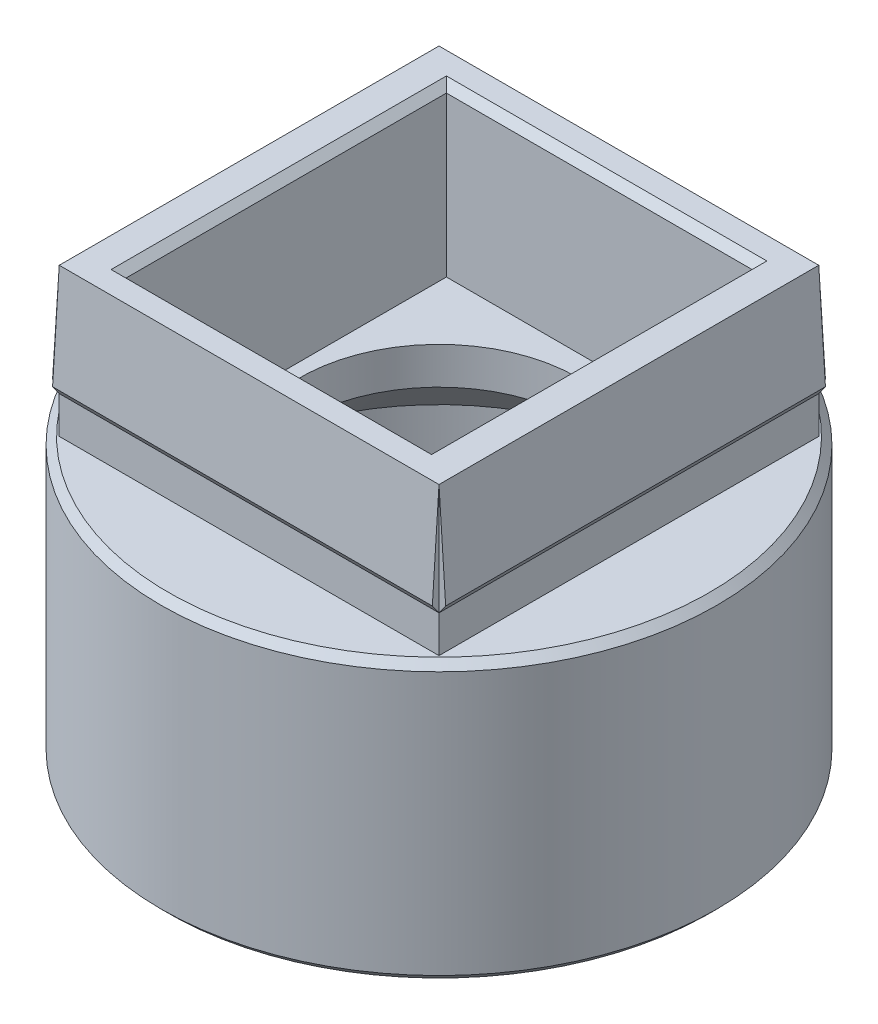
ISO-10303-21;
HEADER;
FILE_DESCRIPTION(('STEP AP214'),'2;1');
FILE_NAME('part.step','',(''),(''),'','','');
FILE_SCHEMA(('AUTOMOTIVE_DESIGN { 1 0 10303 214 1 1 1 1 }'));
ENDSEC;
DATA;
#1=APPLICATION_CONTEXT('core data for automotive mechanical design processes');
#2=APPLICATION_PROTOCOL_DEFINITION('international standard','automotive_design',2000,#1);
#3=PRODUCT_CONTEXT('',#1,'mechanical');
#4=PRODUCT('Part','Part','',(#3));
#5=PRODUCT_RELATED_PRODUCT_CATEGORY('part','',(#4));
#6=PRODUCT_DEFINITION_FORMATION('','',#4);
#7=PRODUCT_DEFINITION_CONTEXT('part definition',#1,'design');
#8=PRODUCT_DEFINITION('design','',#6,#7);
#9=PRODUCT_DEFINITION_SHAPE('','',#8);
#10=(LENGTH_UNIT() NAMED_UNIT(*) SI_UNIT(.MILLI.,.METRE.));
#11=(NAMED_UNIT(*) PLANE_ANGLE_UNIT() SI_UNIT($,.RADIAN.));
#12=(NAMED_UNIT(*) SI_UNIT($,.STERADIAN.) SOLID_ANGLE_UNIT());
#13=UNCERTAINTY_MEASURE_WITH_UNIT(LENGTH_MEASURE(1.E-05),#10,'distance_accuracy_value','');
#14=(GEOMETRIC_REPRESENTATION_CONTEXT(3) GLOBAL_UNCERTAINTY_ASSIGNED_CONTEXT((#13)) GLOBAL_UNIT_ASSIGNED_CONTEXT((#10,
#11,#12)) REPRESENTATION_CONTEXT('',''));
#15=CARTESIAN_POINT('',(0.,0.,0.));
#16=DIRECTION('',(0.,0.,1.));
#17=DIRECTION('',(1.,0.,0.));
#18=AXIS2_PLACEMENT_3D('',#15,#16,#17);
#19=CARTESIAN_POINT('',(0.,-7.5,0.));
#20=DIRECTION('',(0.,1.,0.));
#21=DIRECTION('',(0.,0.,1.));
#22=AXIS2_PLACEMENT_3D('',#19,#20,#21);
#23=CYLINDRICAL_SURFACE('',#22,6.);
#24=CARTESIAN_POINT('',(0.,-3.50000000000003,0.));
#25=DIRECTION('',(0.,1.,0.));
#26=DIRECTION('',(0.,0.,1.));
#27=AXIS2_PLACEMENT_3D('',#24,#25,#26);
#28=CIRCLE('',#27,6.);
#29=CARTESIAN_POINT('',(0.,-3.50000000000003,6.));
#30=VERTEX_POINT('',#29);
#31=EDGE_CURVE('E51',#30,#30,#28,.T.);
#32=ORIENTED_EDGE('',*,*,#31,.T.);
#33=EDGE_LOOP('',(#32));
#34=FACE_BOUND('',#33,.T.);
#35=CARTESIAN_POINT('',(0.,-6.49999999999998,0.));
#36=DIRECTION('',(0.,-1.,0.));
#37=DIRECTION('',(0.,0.,-1.));
#38=AXIS2_PLACEMENT_3D('',#35,#36,#37);
#39=CIRCLE('',#38,6.);
#40=CARTESIAN_POINT('',(0.,-6.49999999999998,-6.));
#41=VERTEX_POINT('',#40);
#42=EDGE_CURVE('E189',#41,#41,#39,.T.);
#43=ORIENTED_EDGE('',*,*,#42,.T.);
#44=EDGE_LOOP('',(#43));
#45=FACE_BOUND('',#44,.T.);
#46=ADVANCED_FACE('F41',(#34,#45),#23,.F.);
#47=CARTESIAN_POINT('',(5.125,4.,5.125));
#48=DIRECTION('',(-1.,0.,0.));
#49=DIRECTION('',(0.,0.,1.));
#50=AXIS2_PLACEMENT_3D('',#47,#48,#49);
#51=PLANE('',#50);
#52=DIRECTION('',(0.,1.,0.));
#53=VECTOR('',#52,1.);
#54=CARTESIAN_POINT('',(5.12500000000005,1.,-5.12499999999995));
#55=LINE('',#54,#53);
#56=CARTESIAN_POINT('',(5.12500000000005,1.,-5.12499999999995));
#57=VERTEX_POINT('',#56);
#58=CARTESIAN_POINT('',(5.12500000000005,4.,-5.12499999999995));
#59=VERTEX_POINT('',#58);
#60=EDGE_CURVE('E391',#57,#59,#55,.T.);
#61=ORIENTED_EDGE('',*,*,#60,.F.);
#62=DIRECTION('',(0.,-0.811534341451495,0.584304725845075));
#63=VECTOR('',#62,1.);
#64=CARTESIAN_POINT('',(5.125,1.25,-5.305));
#65=LINE('',#64,#63);
#66=CARTESIAN_POINT('',(5.125,1.25,-5.305));
#67=VERTEX_POINT('',#66);
#68=EDGE_CURVE('E357',#67,#57,#65,.T.);
#69=ORIENTED_EDGE('',*,*,#68,.F.);
#70=DIRECTION('',(0.,-0.99786470995867,-0.0653147810154764));
#71=VECTOR('',#70,1.);
#72=CARTESIAN_POINT('',(5.125,4.,-5.125));
#73=LINE('',#72,#71);
#74=EDGE_CURVE('E351',#59,#67,#73,.T.);
#75=ORIENTED_EDGE('',*,*,#74,.F.);
#76=EDGE_LOOP('',(#61,#69,#75));
#77=FACE_BOUND('',#76,.T.);
#78=ADVANCED_FACE('F436',(#77),#51,.F.);
#79=DIRECTION('',(0.,0.,-1.));
#80=VECTOR('',#79,1.);
#81=CARTESIAN_POINT('',(5.12499999999995,1.,5.12500000000006));
#82=LINE('',#81,#80);
#83=CARTESIAN_POINT('',(5.12499999999995,1.,5.12500000000006));
#84=VERTEX_POINT('',#83);
#85=EDGE_CURVE('E387',#84,#57,#82,.T.);
#86=ORIENTED_EDGE('',*,*,#85,.F.);
#87=DIRECTION('',(0.,-1.,0.));
#88=VECTOR('',#87,1.);
#89=CARTESIAN_POINT('',(5.125,4.,5.125));
#90=LINE('',#89,#88);
#91=CARTESIAN_POINT('',(5.125,0.,5.125));
#92=VERTEX_POINT('',#91);
#93=EDGE_CURVE('E262',#84,#92,#90,.T.);
#94=ORIENTED_EDGE('',*,*,#93,.T.);
#95=DIRECTION('',(0.,0.,-1.));
#96=VECTOR('',#95,1.);
#97=CARTESIAN_POINT('',(5.125,0.,5.125));
#98=LINE('',#97,#96);
#99=CARTESIAN_POINT('',(5.125,0.,-5.125));
#100=VERTEX_POINT('',#99);
#101=EDGE_CURVE('E280',#92,#100,#98,.T.);
#102=ORIENTED_EDGE('',*,*,#101,.T.);
#103=DIRECTION('',(0.,-1.,0.));
#104=VECTOR('',#103,1.);
#105=CARTESIAN_POINT('',(5.125,4.,-5.125));
#106=LINE('',#105,#104);
#107=EDGE_CURVE('E250',#57,#100,#106,.T.);
#108=ORIENTED_EDGE('',*,*,#107,.F.);
#109=EDGE_LOOP('',(#86,#94,#102,#108));
#110=FACE_BOUND('',#109,.T.);
#111=ADVANCED_FACE('F441',(#110),#51,.F.);
#112=CARTESIAN_POINT('',(-5.125,4.,-5.125));
#113=DIRECTION('',(0.,0.,1.));
#114=DIRECTION('',(1.,0.,0.));
#115=AXIS2_PLACEMENT_3D('',#112,#113,#114);
#116=PLANE('',#115);
#117=DIRECTION('',(0.,1.,0.));
#118=VECTOR('',#117,1.);
#119=CARTESIAN_POINT('',(-5.125,1.,-5.125));
#120=LINE('',#119,#118);
#121=CARTESIAN_POINT('',(-5.125,1.,-5.125));
#122=VERTEX_POINT('',#121);
#123=CARTESIAN_POINT('',(-5.125,4.,-5.125));
#124=VERTEX_POINT('',#123);
#125=EDGE_CURVE('E362',#122,#124,#120,.T.);
#126=ORIENTED_EDGE('',*,*,#125,.F.);
#127=DIRECTION('',(0.584304725845075,-0.811534341451495,0.));
#128=VECTOR('',#127,1.);
#129=CARTESIAN_POINT('',(-5.30499999999998,1.25,-5.12500000000002));
#130=LINE('',#129,#128);
#131=CARTESIAN_POINT('',(-5.30499999999998,1.25,-5.12500000000002));
#132=VERTEX_POINT('',#131);
#133=EDGE_CURVE('E328',#132,#122,#130,.T.);
#134=ORIENTED_EDGE('',*,*,#133,.F.);
#135=DIRECTION('',(-0.0653147810154764,-0.99786470995867,0.));
#136=VECTOR('',#135,1.);
#137=CARTESIAN_POINT('',(-5.12499999999998,4.,-5.12500000000002));
#138=LINE('',#137,#136);
#139=EDGE_CURVE('E336',#124,#132,#138,.T.);
#140=ORIENTED_EDGE('',*,*,#139,.F.);
#141=EDGE_LOOP('',(#126,#134,#140));
#142=FACE_BOUND('',#141,.T.);
#143=ADVANCED_FACE('F532',(#142),#116,.F.);
#144=DIRECTION('',(-1.,0.,0.));
#145=VECTOR('',#144,1.);
#146=CARTESIAN_POINT('',(5.125,1.,-5.125));
#147=LINE('',#146,#145);
#148=EDGE_CURVE('E356',#57,#122,#147,.T.);
#149=ORIENTED_EDGE('',*,*,#148,.F.);
#150=ORIENTED_EDGE('',*,*,#107,.T.);
#151=DIRECTION('',(-1.,0.,0.));
#152=VECTOR('',#151,1.);
#153=CARTESIAN_POINT('',(-5.125,0.,-5.125));
#154=LINE('',#153,#152);
#155=CARTESIAN_POINT('',(-5.125,0.,-5.125));
#156=VERTEX_POINT('',#155);
#157=EDGE_CURVE('E276',#100,#156,#154,.T.);
#158=ORIENTED_EDGE('',*,*,#157,.T.);
#159=DIRECTION('',(0.,-1.,0.));
#160=VECTOR('',#159,1.);
#161=CARTESIAN_POINT('',(-5.125,4.,-5.125));
#162=LINE('',#161,#160);
#163=EDGE_CURVE('E254',#122,#156,#162,.T.);
#164=ORIENTED_EDGE('',*,*,#163,.F.);
#165=EDGE_LOOP('',(#149,#150,#158,#164));
#166=FACE_BOUND('',#165,.T.);
#167=ADVANCED_FACE('F530',(#166),#116,.F.);
#168=CARTESIAN_POINT('',(-5.125,4.,5.125));
#169=DIRECTION('',(1.,0.,0.));
#170=DIRECTION('',(0.,0.,-1.));
#171=AXIS2_PLACEMENT_3D('',#168,#169,#170);
#172=PLANE('',#171);
#173=DIRECTION('',(0.,1.,0.));
#174=VECTOR('',#173,1.);
#175=CARTESIAN_POINT('',(-5.12500000000002,1.,5.12499999999998));
#176=LINE('',#175,#174);
#177=CARTESIAN_POINT('',(-5.12500000000002,1.,5.12499999999998));
#178=VERTEX_POINT('',#177);
#179=CARTESIAN_POINT('',(-5.125,4.,5.125));
#180=VERTEX_POINT('',#179);
#181=EDGE_CURVE('E341',#178,#180,#176,.T.);
#182=ORIENTED_EDGE('',*,*,#181,.F.);
#183=DIRECTION('',(0.,-0.811534341451495,-0.584304725845075));
#184=VECTOR('',#183,1.);
#185=CARTESIAN_POINT('',(-5.125,1.25,5.305));
#186=LINE('',#185,#184);
#187=CARTESIAN_POINT('',(-5.125,1.25,5.305));
#188=VERTEX_POINT('',#187);
#189=EDGE_CURVE('E306',#188,#178,#186,.T.);
#190=ORIENTED_EDGE('',*,*,#189,.F.);
#191=DIRECTION('',(0.,-0.99786470995867,0.0653147810154764));
#192=VECTOR('',#191,1.);
#193=CARTESIAN_POINT('',(-5.125,4.,5.125));
#194=LINE('',#193,#192);
#195=EDGE_CURVE('E314',#180,#188,#194,.T.);
#196=ORIENTED_EDGE('',*,*,#195,.F.);
#197=EDGE_LOOP('',(#182,#190,#196));
#198=FACE_BOUND('',#197,.T.);
#199=ADVANCED_FACE('F527',(#198),#172,.F.);
#200=DIRECTION('',(0.,0.,1.));
#201=VECTOR('',#200,1.);
#202=CARTESIAN_POINT('',(-5.12499999999998,1.,-5.12500000000002));
#203=LINE('',#202,#201);
#204=EDGE_CURVE('E319',#122,#178,#203,.T.);
#205=ORIENTED_EDGE('',*,*,#204,.F.);
#206=ORIENTED_EDGE('',*,*,#163,.T.);
#207=DIRECTION('',(0.,0.,1.));
#208=VECTOR('',#207,1.);
#209=CARTESIAN_POINT('',(-5.125,0.,5.125));
#210=LINE('',#209,#208);
#211=CARTESIAN_POINT('',(-5.125,0.,5.125));
#212=VERTEX_POINT('',#211);
#213=EDGE_CURVE('E272',#156,#212,#210,.T.);
#214=ORIENTED_EDGE('',*,*,#213,.T.);
#215=DIRECTION('',(0.,-1.,0.));
#216=VECTOR('',#215,1.);
#217=CARTESIAN_POINT('',(-5.125,4.,5.125));
#218=LINE('',#217,#216);
#219=EDGE_CURVE('E258',#178,#212,#218,.T.);
#220=ORIENTED_EDGE('',*,*,#219,.F.);
#221=EDGE_LOOP('',(#205,#206,#214,#220));
#222=FACE_BOUND('',#221,.T.);
#223=ADVANCED_FACE('F525',(#222),#172,.F.);
#224=CARTESIAN_POINT('',(-5.125,4.,5.125));
#225=DIRECTION('',(0.,0.,-1.));
#226=DIRECTION('',(-1.,0.,0.));
#227=AXIS2_PLACEMENT_3D('',#224,#225,#226);
#228=PLANE('',#227);
#229=DIRECTION('',(1.,0.,0.));
#230=VECTOR('',#229,1.);
#231=CARTESIAN_POINT('',(-5.125,1.,5.125));
#232=LINE('',#231,#230);
#233=EDGE_CURVE('E170',#178,#84,#232,.T.);
#234=ORIENTED_EDGE('',*,*,#233,.F.);
#235=ORIENTED_EDGE('',*,*,#219,.T.);
#236=DIRECTION('',(1.,0.,0.));
#237=VECTOR('',#236,1.);
#238=CARTESIAN_POINT('',(-5.125,0.,5.125));
#239=LINE('',#238,#237);
#240=EDGE_CURVE('E267',#212,#92,#239,.T.);
#241=ORIENTED_EDGE('',*,*,#240,.T.);
#242=ORIENTED_EDGE('',*,*,#93,.F.);
#243=EDGE_LOOP('',(#234,#235,#241,#242));
#244=FACE_BOUND('',#243,.T.);
#245=ADVANCED_FACE('F521',(#244),#228,.F.);
#246=CARTESIAN_POINT('',(0.,4.,0.));
#247=DIRECTION('',(0.,-1.,0.));
#248=DIRECTION('',(0.,0.,-1.));
#249=AXIS2_PLACEMENT_3D('',#246,#247,#248);
#250=PLANE('',#249);
#251=DIRECTION('',(-1.,0.,0.));
#252=VECTOR('',#251,1.);
#253=CARTESIAN_POINT('',(-4.125,4.,4.525));
#254=LINE('',#253,#252);
#255=CARTESIAN_POINT('',(4.325,4.,4.525));
#256=VERTEX_POINT('',#255);
#257=CARTESIAN_POINT('',(-4.325,4.,4.525));
#258=VERTEX_POINT('',#257);
#259=EDGE_CURVE('E237',#256,#258,#254,.T.);
#260=ORIENTED_EDGE('',*,*,#259,.T.);
#261=DIRECTION('',(0.,0.,-1.));
#262=VECTOR('',#261,1.);
#263=CARTESIAN_POINT('',(-4.325,4.,-4.325));
#264=LINE('',#263,#262);
#265=CARTESIAN_POINT('',(-4.325,4.,-4.525));
#266=VERTEX_POINT('',#265);
#267=EDGE_CURVE('E233',#258,#266,#264,.T.);
#268=ORIENTED_EDGE('',*,*,#267,.T.);
#269=DIRECTION('',(1.,0.,0.));
#270=VECTOR('',#269,1.);
#271=CARTESIAN_POINT('',(4.125,4.,-4.525));
#272=LINE('',#271,#270);
#273=CARTESIAN_POINT('',(4.325,4.,-4.525));
#274=VERTEX_POINT('',#273);
#275=EDGE_CURVE('E243',#266,#274,#272,.T.);
#276=ORIENTED_EDGE('',*,*,#275,.T.);
#277=DIRECTION('',(0.,0.,1.));
#278=VECTOR('',#277,1.);
#279=CARTESIAN_POINT('',(4.325,4.,4.325));
#280=LINE('',#279,#278);
#281=EDGE_CURVE('E240',#274,#256,#280,.T.);
#282=ORIENTED_EDGE('',*,*,#281,.T.);
#283=EDGE_LOOP('',(#260,#268,#276,#282));
#284=FACE_BOUND('',#283,.T.);
#285=DIRECTION('',(0.,0.,-1.));
#286=VECTOR('',#285,1.);
#287=CARTESIAN_POINT('',(5.125,4.,5.125));
#288=LINE('',#287,#286);
#289=CARTESIAN_POINT('',(5.125,4.,5.125));
#290=VERTEX_POINT('',#289);
#291=EDGE_CURVE('E271',#290,#59,#288,.T.);
#292=ORIENTED_EDGE('',*,*,#291,.T.);
#293=DIRECTION('',(-1.,0.,0.));
#294=VECTOR('',#293,1.);
#295=CARTESIAN_POINT('',(-5.125,4.,-5.125));
#296=LINE('',#295,#294);
#297=EDGE_CURVE('E290',#59,#124,#296,.T.);
#298=ORIENTED_EDGE('',*,*,#297,.T.);
#299=DIRECTION('',(0.,0.,1.));
#300=VECTOR('',#299,1.);
#301=CARTESIAN_POINT('',(-5.125,4.,5.125));
#302=LINE('',#301,#300);
#303=EDGE_CURVE('E287',#124,#180,#302,.T.);
#304=ORIENTED_EDGE('',*,*,#303,.T.);
#305=DIRECTION('',(1.,0.,0.));
#306=VECTOR('',#305,1.);
#307=CARTESIAN_POINT('',(-5.125,4.,5.125));
#308=LINE('',#307,#306);
#309=EDGE_CURVE('E266',#180,#290,#308,.T.);
#310=ORIENTED_EDGE('',*,*,#309,.T.);
#311=EDGE_LOOP('',(#292,#298,#304,#310));
#312=FACE_BOUND('',#311,.T.);
#313=ADVANCED_FACE('F518',(#284,#312),#250,.F.);
#314=DIRECTION('',(0.,-0.811534341451495,-0.584304725845075));
#315=VECTOR('',#314,1.);
#316=CARTESIAN_POINT('',(5.125,1.25,5.305));
#317=LINE('',#316,#315);
#318=CARTESIAN_POINT('',(5.125,1.25,5.305));
#319=VERTEX_POINT('',#318);
#320=EDGE_CURVE('E310',#319,#84,#317,.T.);
#321=ORIENTED_EDGE('',*,*,#320,.T.);
#322=DIRECTION('',(0.,1.,0.));
#323=VECTOR('',#322,1.);
#324=CARTESIAN_POINT('',(5.12499999999995,1.,5.12500000000006));
#325=LINE('',#324,#323);
#326=EDGE_CURVE('E200',#84,#290,#325,.T.);
#327=ORIENTED_EDGE('',*,*,#326,.T.);
#328=DIRECTION('',(0.,-0.99786470995867,0.0653147810154764));
#329=VECTOR('',#328,1.);
#330=CARTESIAN_POINT('',(5.125,4.,5.125));
#331=LINE('',#330,#329);
#332=EDGE_CURVE('E315',#290,#319,#331,.T.);
#333=ORIENTED_EDGE('',*,*,#332,.T.);
#334=EDGE_LOOP('',(#321,#327,#333));
#335=FACE_BOUND('',#334,.T.);
#336=ADVANCED_FACE('F444',(#335),#51,.F.);
#337=CARTESIAN_POINT('',(4.125,4.,4.325));
#338=DIRECTION('',(-1.,0.,0.));
#339=DIRECTION('',(0.,0.,1.));
#340=AXIS2_PLACEMENT_3D('',#337,#338,#339);
#341=PLANE('',#340);
#342=DIRECTION('',(0.,0.,-1.));
#343=VECTOR('',#342,1.);
#344=CARTESIAN_POINT('',(4.125,-0.5,4.325));
#345=LINE('',#344,#343);
#346=CARTESIAN_POINT('',(4.125,-0.5,4.325));
#347=VERTEX_POINT('',#346);
#348=CARTESIAN_POINT('',(4.125,-0.5,-4.325));
#349=VERTEX_POINT('',#348);
#350=EDGE_CURVE('E173',#347,#349,#345,.T.);
#351=ORIENTED_EDGE('',*,*,#350,.F.);
#352=DIRECTION('',(0.,-1.,0.));
#353=VECTOR('',#352,1.);
#354=CARTESIAN_POINT('',(4.125,4.,4.325));
#355=LINE('',#354,#353);
#356=CARTESIAN_POINT('',(4.125,3.8,4.325));
#357=VERTEX_POINT('',#356);
#358=EDGE_CURVE('E158',#357,#347,#355,.T.);
#359=ORIENTED_EDGE('',*,*,#358,.F.);
#360=DIRECTION('',(0.,0.,-1.));
#361=VECTOR('',#360,1.);
#362=CARTESIAN_POINT('',(4.125,3.8,-4.325));
#363=LINE('',#362,#361);
#364=CARTESIAN_POINT('',(4.125,3.8,-4.325));
#365=VERTEX_POINT('',#364);
#366=EDGE_CURVE('E228',#357,#365,#363,.T.);
#367=ORIENTED_EDGE('',*,*,#366,.T.);
#368=DIRECTION('',(0.,-1.,0.));
#369=VECTOR('',#368,1.);
#370=CARTESIAN_POINT('',(4.125,4.,-4.325));
#371=LINE('',#370,#369);
#372=EDGE_CURVE('E175',#365,#349,#371,.T.);
#373=ORIENTED_EDGE('',*,*,#372,.T.);
#374=EDGE_LOOP('',(#351,#359,#367,#373));
#375=FACE_BOUND('',#374,.T.);
#376=ADVANCED_FACE('F174',(#375),#341,.T.);
#377=CARTESIAN_POINT('',(-4.125,4.,-4.325));
#378=DIRECTION('',(0.,0.,1.));
#379=DIRECTION('',(1.,0.,0.));
#380=AXIS2_PLACEMENT_3D('',#377,#378,#379);
#381=PLANE('',#380);
#382=DIRECTION('',(-1.,0.,0.));
#383=VECTOR('',#382,1.);
#384=CARTESIAN_POINT('',(-4.125,-0.5,-4.325));
#385=LINE('',#384,#383);
#386=CARTESIAN_POINT('',(-4.125,-0.5,-4.325));
#387=VERTEX_POINT('',#386);
#388=EDGE_CURVE('E58',#349,#387,#385,.T.);
#389=ORIENTED_EDGE('',*,*,#388,.F.);
#390=ORIENTED_EDGE('',*,*,#372,.F.);
#391=DIRECTION('',(-1.,0.,0.));
#392=VECTOR('',#391,1.);
#393=CARTESIAN_POINT('',(-4.125,3.8,-4.325));
#394=LINE('',#393,#392);
#395=CARTESIAN_POINT('',(-4.125,3.8,-4.325));
#396=VERTEX_POINT('',#395);
#397=EDGE_CURVE('E225',#365,#396,#394,.T.);
#398=ORIENTED_EDGE('',*,*,#397,.T.);
#399=DIRECTION('',(0.,-1.,0.));
#400=VECTOR('',#399,1.);
#401=CARTESIAN_POINT('',(-4.125,4.,-4.325));
#402=LINE('',#401,#400);
#403=EDGE_CURVE('E298',#396,#387,#402,.T.);
#404=ORIENTED_EDGE('',*,*,#403,.T.);
#405=EDGE_LOOP('',(#389,#390,#398,#404));
#406=FACE_BOUND('',#405,.T.);
#407=ADVANCED_FACE('F513',(#406),#381,.T.);
#408=CARTESIAN_POINT('',(-4.125,4.,4.325));
#409=DIRECTION('',(1.,0.,0.));
#410=DIRECTION('',(0.,0.,-1.));
#411=AXIS2_PLACEMENT_3D('',#408,#409,#410);
#412=PLANE('',#411);
#413=DIRECTION('',(0.,0.,1.));
#414=VECTOR('',#413,1.);
#415=CARTESIAN_POINT('',(-4.125,-0.5,4.325));
#416=LINE('',#415,#414);
#417=CARTESIAN_POINT('',(-4.125,-0.5,4.325));
#418=VERTEX_POINT('',#417);
#419=EDGE_CURVE('E66',#387,#418,#416,.T.);
#420=ORIENTED_EDGE('',*,*,#419,.F.);
#421=ORIENTED_EDGE('',*,*,#403,.F.);
#422=DIRECTION('',(0.,0.,1.));
#423=VECTOR('',#422,1.);
#424=CARTESIAN_POINT('',(-4.125,3.8,4.325));
#425=LINE('',#424,#423);
#426=CARTESIAN_POINT('',(-4.125,3.8,4.325));
#427=VERTEX_POINT('',#426);
#428=EDGE_CURVE('E246',#396,#427,#425,.T.);
#429=ORIENTED_EDGE('',*,*,#428,.T.);
#430=DIRECTION('',(0.,-1.,0.));
#431=VECTOR('',#430,1.);
#432=CARTESIAN_POINT('',(-4.125,4.,4.325));
#433=LINE('',#432,#431);
#434=EDGE_CURVE('E169',#427,#418,#433,.T.);
#435=ORIENTED_EDGE('',*,*,#434,.T.);
#436=EDGE_LOOP('',(#420,#421,#429,#435));
#437=FACE_BOUND('',#436,.T.);
#438=ADVANCED_FACE('F510',(#437),#412,.T.);
#439=CARTESIAN_POINT('',(-4.125,4.,4.325));
#440=DIRECTION('',(0.,0.,-1.));
#441=DIRECTION('',(-1.,0.,0.));
#442=AXIS2_PLACEMENT_3D('',#439,#440,#441);
#443=PLANE('',#442);
#444=DIRECTION('',(1.,0.,0.));
#445=VECTOR('',#444,1.);
#446=CARTESIAN_POINT('',(-4.125,-0.5,4.325));
#447=LINE('',#446,#445);
#448=EDGE_CURVE('E163',#418,#347,#447,.T.);
#449=ORIENTED_EDGE('',*,*,#448,.F.);
#450=ORIENTED_EDGE('',*,*,#434,.F.);
#451=DIRECTION('',(1.,0.,0.));
#452=VECTOR('',#451,1.);
#453=CARTESIAN_POINT('',(4.125,3.8,4.325));
#454=LINE('',#453,#452);
#455=EDGE_CURVE('E165',#427,#357,#454,.T.);
#456=ORIENTED_EDGE('',*,*,#455,.T.);
#457=ORIENTED_EDGE('',*,*,#358,.T.);
#458=EDGE_LOOP('',(#449,#450,#456,#457));
#459=FACE_BOUND('',#458,.T.);
#460=ADVANCED_FACE('F160',(#459),#443,.T.);
#461=CARTESIAN_POINT('',(-5.125,1.25,5.305));
#462=DIRECTION('',(0.,-0.584304725845075,0.811534341451495));
#463=DIRECTION('',(0.,-0.811534341451495,-0.584304725845075));
#464=AXIS2_PLACEMENT_3D('',#461,#462,#463);
#465=PLANE('',#464);
#466=ORIENTED_EDGE('',*,*,#320,.F.);
#467=DIRECTION('',(1.,0.,0.));
#468=VECTOR('',#467,1.);
#469=CARTESIAN_POINT('',(-5.125,1.25,5.305));
#470=LINE('',#469,#468);
#471=EDGE_CURVE('E303',#188,#319,#470,.T.);
#472=ORIENTED_EDGE('',*,*,#471,.F.);
#473=ORIENTED_EDGE('',*,*,#189,.T.);
#474=ORIENTED_EDGE('',*,*,#233,.T.);
#475=EDGE_LOOP('',(#466,#472,#473,#474));
#476=FACE_BOUND('',#475,.T.);
#477=ADVANCED_FACE('F501',(#476),#465,.T.);
#478=CARTESIAN_POINT('',(-5.125,4.,5.125));
#479=DIRECTION('',(0.,0.0653147810154764,0.99786470995867));
#480=DIRECTION('',(0.,-0.99786470995867,0.0653147810154764));
#481=AXIS2_PLACEMENT_3D('',#478,#479,#480);
#482=PLANE('',#481);
#483=ORIENTED_EDGE('',*,*,#332,.F.);
#484=ORIENTED_EDGE('',*,*,#309,.F.);
#485=ORIENTED_EDGE('',*,*,#195,.T.);
#486=ORIENTED_EDGE('',*,*,#471,.T.);
#487=EDGE_LOOP('',(#483,#484,#485,#486));
#488=FACE_BOUND('',#487,.T.);
#489=ADVANCED_FACE('F496',(#488),#482,.T.);
#490=CARTESIAN_POINT('',(-5.30499999999998,1.25,-5.12500000000002));
#491=DIRECTION('',(-0.811534341451495,-0.584304725845075,0.));
#492=DIRECTION('',(0.584304725845075,-0.811534341451495,0.));
#493=AXIS2_PLACEMENT_3D('',#490,#491,#492);
#494=PLANE('',#493);
#495=DIRECTION('',(0.584304725845075,-0.811534341451495,0.));
#496=VECTOR('',#495,1.);
#497=CARTESIAN_POINT('',(-5.30500000000002,1.25,5.12499999999998));
#498=LINE('',#497,#496);
#499=CARTESIAN_POINT('',(-5.30500000000002,1.25,5.12499999999998));
#500=VERTEX_POINT('',#499);
#501=EDGE_CURVE('E332',#500,#178,#498,.T.);
#502=ORIENTED_EDGE('',*,*,#501,.F.);
#503=DIRECTION('',(0.,0.,1.));
#504=VECTOR('',#503,1.);
#505=CARTESIAN_POINT('',(-5.30499999999998,1.25,-5.12500000000002));
#506=LINE('',#505,#504);
#507=EDGE_CURVE('E325',#132,#500,#506,.T.);
#508=ORIENTED_EDGE('',*,*,#507,.F.);
#509=ORIENTED_EDGE('',*,*,#133,.T.);
#510=ORIENTED_EDGE('',*,*,#204,.T.);
#511=EDGE_LOOP('',(#502,#508,#509,#510));
#512=FACE_BOUND('',#511,.T.);
#513=ADVANCED_FACE('F493',(#512),#494,.T.);
#514=CARTESIAN_POINT('',(-5.12499999999998,4.,-5.12500000000002));
#515=DIRECTION('',(-0.99786470995867,0.0653147810154764,0.));
#516=DIRECTION('',(-0.0653147810154764,-0.99786470995867,0.));
#517=AXIS2_PLACEMENT_3D('',#514,#515,#516);
#518=PLANE('',#517);
#519=DIRECTION('',(-0.0653147810154764,-0.99786470995867,0.));
#520=VECTOR('',#519,1.);
#521=CARTESIAN_POINT('',(-5.12500000000002,4.,5.12499999999998));
#522=LINE('',#521,#520);
#523=EDGE_CURVE('E337',#180,#500,#522,.T.);
#524=ORIENTED_EDGE('',*,*,#523,.F.);
#525=ORIENTED_EDGE('',*,*,#303,.F.);
#526=ORIENTED_EDGE('',*,*,#139,.T.);
#527=ORIENTED_EDGE('',*,*,#507,.T.);
#528=EDGE_LOOP('',(#524,#525,#526,#527));
#529=FACE_BOUND('',#528,.T.);
#530=ADVANCED_FACE('F491',(#529),#518,.T.);
#531=CARTESIAN_POINT('',(0.,0.,5.125));
#532=DIRECTION('',(0.,0.,-1.));
#533=DIRECTION('',(-1.,0.,0.));
#534=AXIS2_PLACEMENT_3D('',#531,#532,#533);
#535=PLANE('',#534);
#536=ORIENTED_EDGE('',*,*,#181,.T.);
#537=ORIENTED_EDGE('',*,*,#523,.T.);
#538=ORIENTED_EDGE('',*,*,#501,.T.);
#539=EDGE_LOOP('',(#536,#537,#538));
#540=FACE_BOUND('',#539,.T.);
#541=ADVANCED_FACE('F484',(#540),#535,.F.);
#542=CARTESIAN_POINT('',(5.125,1.25,-5.305));
#543=DIRECTION('',(0.,-0.584304725845075,-0.811534341451495));
#544=DIRECTION('',(0.,0.811534341451495,-0.584304725845075));
#545=AXIS2_PLACEMENT_3D('',#542,#543,#544);
#546=PLANE('',#545);
#547=DIRECTION('',(0.,-0.811534341451495,0.584304725845075));
#548=VECTOR('',#547,1.);
#549=CARTESIAN_POINT('',(-5.125,1.25,-5.305));
#550=LINE('',#549,#548);
#551=CARTESIAN_POINT('',(-5.125,1.25,-5.305));
#552=VERTEX_POINT('',#551);
#553=EDGE_CURVE('E345',#552,#122,#550,.T.);
#554=ORIENTED_EDGE('',*,*,#553,.F.);
#555=DIRECTION('',(-1.,0.,0.));
#556=VECTOR('',#555,1.);
#557=CARTESIAN_POINT('',(5.125,1.25,-5.305));
#558=LINE('',#557,#556);
#559=EDGE_CURVE('E355',#67,#552,#558,.T.);
#560=ORIENTED_EDGE('',*,*,#559,.F.);
#561=ORIENTED_EDGE('',*,*,#68,.T.);
#562=ORIENTED_EDGE('',*,*,#148,.T.);
#563=EDGE_LOOP('',(#554,#560,#561,#562));
#564=FACE_BOUND('',#563,.T.);
#565=ADVANCED_FACE('F480',(#564),#546,.T.);
#566=CARTESIAN_POINT('',(5.125,4.,-5.125));
#567=DIRECTION('',(0.,0.0653147810154764,-0.99786470995867));
#568=DIRECTION('',(0.,0.99786470995867,0.0653147810154764));
#569=AXIS2_PLACEMENT_3D('',#566,#567,#568);
#570=PLANE('',#569);
#571=DIRECTION('',(0.,-0.99786470995867,-0.0653147810154764));
#572=VECTOR('',#571,1.);
#573=CARTESIAN_POINT('',(-5.125,4.,-5.125));
#574=LINE('',#573,#572);
#575=EDGE_CURVE('E366',#124,#552,#574,.T.);
#576=ORIENTED_EDGE('',*,*,#575,.F.);
#577=ORIENTED_EDGE('',*,*,#297,.F.);
#578=ORIENTED_EDGE('',*,*,#74,.T.);
#579=ORIENTED_EDGE('',*,*,#559,.T.);
#580=EDGE_LOOP('',(#576,#577,#578,#579));
#581=FACE_BOUND('',#580,.T.);
#582=ADVANCED_FACE('F477',(#581),#570,.T.);
#583=CARTESIAN_POINT('',(-5.125,0.,0.));
#584=DIRECTION('',(1.,0.,0.));
#585=DIRECTION('',(0.,0.,-1.));
#586=AXIS2_PLACEMENT_3D('',#583,#584,#585);
#587=PLANE('',#586);
#588=ORIENTED_EDGE('',*,*,#125,.T.);
#589=ORIENTED_EDGE('',*,*,#575,.T.);
#590=ORIENTED_EDGE('',*,*,#553,.T.);
#591=EDGE_LOOP('',(#588,#589,#590));
#592=FACE_BOUND('',#591,.T.);
#593=ADVANCED_FACE('F469',(#592),#587,.F.);
#594=CARTESIAN_POINT('',(5.30499999999995,1.25,5.12500000000006));
#595=DIRECTION('',(0.811534341451495,-0.584304725845075,0.));
#596=DIRECTION('',(0.584304725845075,0.811534341451495,0.));
#597=AXIS2_PLACEMENT_3D('',#594,#595,#596);
#598=PLANE('',#597);
#599=DIRECTION('',(-0.584304725845075,-0.811534341451495,0.));
#600=VECTOR('',#599,1.);
#601=CARTESIAN_POINT('',(5.30500000000005,1.25,-5.12499999999994));
#602=LINE('',#601,#600);
#603=CARTESIAN_POINT('',(5.30500000000005,1.25,-5.12499999999994));
#604=VERTEX_POINT('',#603);
#605=EDGE_CURVE('E361',#604,#57,#602,.T.);
#606=ORIENTED_EDGE('',*,*,#605,.F.);
#607=DIRECTION('',(0.,0.,-1.));
#608=VECTOR('',#607,1.);
#609=CARTESIAN_POINT('',(5.30499999999995,1.25,5.12500000000006));
#610=LINE('',#609,#608);
#611=CARTESIAN_POINT('',(5.30499999999995,1.25,5.12500000000006));
#612=VERTEX_POINT('',#611);
#613=EDGE_CURVE('E386',#612,#604,#610,.T.);
#614=ORIENTED_EDGE('',*,*,#613,.F.);
#615=DIRECTION('',(-0.584304725845075,-0.811534341451495,0.));
#616=VECTOR('',#615,1.);
#617=CARTESIAN_POINT('',(5.30499999999995,1.25,5.12500000000006));
#618=LINE('',#617,#616);
#619=EDGE_CURVE('E381',#612,#84,#618,.T.);
#620=ORIENTED_EDGE('',*,*,#619,.T.);
#621=ORIENTED_EDGE('',*,*,#85,.T.);
#622=EDGE_LOOP('',(#606,#614,#620,#621));
#623=FACE_BOUND('',#622,.T.);
#624=ADVANCED_FACE('F465',(#623),#598,.T.);
#625=CARTESIAN_POINT('',(5.12499999999995,4.,5.12500000000006));
#626=DIRECTION('',(0.99786470995867,0.0653147810154764,0.));
#627=DIRECTION('',(-0.0653147810154764,0.99786470995867,0.));
#628=AXIS2_PLACEMENT_3D('',#625,#626,#627);
#629=PLANE('',#628);
#630=DIRECTION('',(0.0653147810154764,-0.99786470995867,0.));
#631=VECTOR('',#630,1.);
#632=CARTESIAN_POINT('',(5.12500000000005,4.,-5.12499999999995));
#633=LINE('',#632,#631);
#634=EDGE_CURVE('E395',#59,#604,#633,.T.);
#635=ORIENTED_EDGE('',*,*,#634,.F.);
#636=ORIENTED_EDGE('',*,*,#291,.F.);
#637=DIRECTION('',(0.0653147810154764,-0.99786470995867,0.));
#638=VECTOR('',#637,1.);
#639=CARTESIAN_POINT('',(5.12499999999995,4.,5.12500000000006));
#640=LINE('',#639,#638);
#641=EDGE_CURVE('E382',#290,#612,#640,.T.);
#642=ORIENTED_EDGE('',*,*,#641,.T.);
#643=ORIENTED_EDGE('',*,*,#613,.T.);
#644=EDGE_LOOP('',(#635,#636,#642,#643));
#645=FACE_BOUND('',#644,.T.);
#646=ADVANCED_FACE('F461',(#645),#629,.T.);
#647=CARTESIAN_POINT('',(0.,0.,5.125));
#648=DIRECTION('',(0.,0.,1.));
#649=DIRECTION('',(1.,0.,0.));
#650=AXIS2_PLACEMENT_3D('',#647,#648,#649);
#651=PLANE('',#650);
#652=ORIENTED_EDGE('',*,*,#326,.F.);
#653=ORIENTED_EDGE('',*,*,#619,.F.);
#654=ORIENTED_EDGE('',*,*,#641,.F.);
#655=EDGE_LOOP('',(#652,#653,#654));
#656=FACE_BOUND('',#655,.T.);
#657=ADVANCED_FACE('F464',(#656),#651,.T.);
#658=CARTESIAN_POINT('',(0.,0.,-5.125));
#659=DIRECTION('',(0.,0.,1.));
#660=DIRECTION('',(1.,0.,0.));
#661=AXIS2_PLACEMENT_3D('',#658,#659,#660);
#662=PLANE('',#661);
#663=ORIENTED_EDGE('',*,*,#60,.T.);
#664=ORIENTED_EDGE('',*,*,#634,.T.);
#665=ORIENTED_EDGE('',*,*,#605,.T.);
#666=EDGE_LOOP('',(#663,#664,#665));
#667=FACE_BOUND('',#666,.T.);
#668=ADVANCED_FACE('F456',(#667),#662,.F.);
#669=CARTESIAN_POINT('',(0.,0.,0.));
#670=DIRECTION('',(0.,-1.,0.));
#671=DIRECTION('',(0.,0.,-1.));
#672=AXIS2_PLACEMENT_3D('',#669,#670,#671);
#673=PLANE('',#672);
#674=CARTESIAN_POINT('',(0.,0.,0.));
#675=DIRECTION('',(0.,-1.,0.));
#676=DIRECTION('',(0.,0.,-1.));
#677=AXIS2_PLACEMENT_3D('',#674,#675,#676);
#678=CIRCLE('',#677,7.3);
#679=CARTESIAN_POINT('',(0.,0.,-7.3));
#680=VERTEX_POINT('',#679);
#681=EDGE_CURVE('E213',#680,#680,#678,.F.);
#682=ORIENTED_EDGE('',*,*,#681,.T.);
#683=EDGE_LOOP('',(#682));
#684=FACE_BOUND('',#683,.T.);
#685=ORIENTED_EDGE('',*,*,#101,.F.);
#686=ORIENTED_EDGE('',*,*,#240,.F.);
#687=ORIENTED_EDGE('',*,*,#213,.F.);
#688=ORIENTED_EDGE('',*,*,#157,.F.);
#689=EDGE_LOOP('',(#685,#686,#687,#688));
#690=FACE_BOUND('',#689,.T.);
#691=ADVANCED_FACE('F453',(#684,#690),#673,.F.);
#692=CARTESIAN_POINT('',(0.,-1.,0.));
#693=DIRECTION('',(0.,1.,0.));
#694=DIRECTION('',(0.,0.,1.));
#695=AXIS2_PLACEMENT_3D('',#692,#693,#694);
#696=CYLINDRICAL_SURFACE('',#695,7.5);
#697=CARTESIAN_POINT('',(0.,-0.199999999999996,0.));
#698=DIRECTION('',(0.,-1.,0.));
#699=DIRECTION('',(0.,0.,-1.));
#700=AXIS2_PLACEMENT_3D('',#697,#698,#699);
#701=CIRCLE('',#700,7.5);
#702=CARTESIAN_POINT('',(0.,-0.199999999999996,-7.5));
#703=VERTEX_POINT('',#702);
#704=EDGE_CURVE('E217',#703,#703,#701,.T.);
#705=ORIENTED_EDGE('',*,*,#704,.T.);
#706=EDGE_LOOP('',(#705));
#707=FACE_BOUND('',#706,.T.);
#708=CARTESIAN_POINT('',(0.,-7.3,0.));
#709=DIRECTION('',(0.,-1.,0.));
#710=DIRECTION('',(0.,0.,-1.));
#711=AXIS2_PLACEMENT_3D('',#708,#709,#710);
#712=CIRCLE('',#711,7.5);
#713=CARTESIAN_POINT('',(0.,-7.3,-7.5));
#714=VERTEX_POINT('',#713);
#715=EDGE_CURVE('E221',#714,#714,#712,.F.);
#716=ORIENTED_EDGE('',*,*,#715,.T.);
#717=EDGE_LOOP('',(#716));
#718=FACE_BOUND('',#717,.T.);
#719=ADVANCED_FACE('F451',(#707,#718),#696,.T.);
#720=CARTESIAN_POINT('',(0.,-7.5,0.));
#721=DIRECTION('',(0.,-1.,0.));
#722=DIRECTION('',(0.,0.,-1.));
#723=AXIS2_PLACEMENT_3D('',#720,#721,#722);
#724=PLANE('',#723);
#725=CARTESIAN_POINT('',(0.,-7.5,0.));
#726=DIRECTION('',(0.,-1.,0.));
#727=DIRECTION('',(0.,0.,-1.));
#728=AXIS2_PLACEMENT_3D('',#725,#726,#727);
#729=CIRCLE('',#728,7.00000000000002);
#730=CARTESIAN_POINT('',(0.,-7.5,-7.00000000000002));
#731=VERTEX_POINT('',#730);
#732=EDGE_CURVE('E183',#731,#731,#729,.F.);
#733=ORIENTED_EDGE('',*,*,#732,.T.);
#734=EDGE_LOOP('',(#733));
#735=FACE_BOUND('',#734,.T.);
#736=CARTESIAN_POINT('',(0.,-7.5,0.));
#737=DIRECTION('',(0.,-1.,0.));
#738=DIRECTION('',(0.,0.,-1.));
#739=AXIS2_PLACEMENT_3D('',#736,#737,#738);
#740=CIRCLE('',#739,7.3);
#741=CARTESIAN_POINT('',(0.,-7.5,-7.3));
#742=VERTEX_POINT('',#741);
#743=EDGE_CURVE('E195',#742,#742,#740,.T.);
#744=ORIENTED_EDGE('',*,*,#743,.T.);
#745=EDGE_LOOP('',(#744));
#746=FACE_BOUND('',#745,.T.);
#747=ADVANCED_FACE('F447',(#735,#746),#724,.T.);
#748=CARTESIAN_POINT('',(4.125,3.8,4.325));
#749=DIRECTION('',(-0.707106781186548,0.707106781186548,0.));
#750=DIRECTION('',(0.,0.,1.));
#751=AXIS2_PLACEMENT_3D('',#748,#749,#750);
#752=PLANE('',#751);
#753=DIRECTION('',(0.577350269189626,0.577350269189626,0.577350269189626));
#754=VECTOR('',#753,1.);
#755=CARTESIAN_POINT('',(1.375,1.05,1.575));
#756=LINE('',#755,#754);
#757=EDGE_CURVE('E201',#256,#357,#756,.F.);
#758=ORIENTED_EDGE('',*,*,#757,.F.);
#759=ORIENTED_EDGE('',*,*,#281,.F.);
#760=DIRECTION('',(0.577350269189626,0.577350269189626,-0.577350269189626));
#761=VECTOR('',#760,1.);
#762=CARTESIAN_POINT('',(1.24166666666667,0.916666666666668,-1.44166666666667));
#763=LINE('',#762,#761);
#764=EDGE_CURVE('E196',#365,#274,#763,.T.);
#765=ORIENTED_EDGE('',*,*,#764,.F.);
#766=ORIENTED_EDGE('',*,*,#366,.F.);
#767=EDGE_LOOP('',(#758,#759,#765,#766));
#768=FACE_BOUND('',#767,.T.);
#769=ADVANCED_FACE('F450',(#768),#752,.T.);
#770=CARTESIAN_POINT('',(-4.125,3.8,-4.325));
#771=DIRECTION('',(0.,0.707106781186548,0.707106781186548));
#772=DIRECTION('',(1.,0.,0.));
#773=AXIS2_PLACEMENT_3D('',#770,#771,#772);
#774=PLANE('',#773);
#775=ORIENTED_EDGE('',*,*,#764,.T.);
#776=ORIENTED_EDGE('',*,*,#275,.F.);
#777=DIRECTION('',(0.577350269189626,-0.577350269189626,0.577350269189626));
#778=VECTOR('',#777,1.);
#779=CARTESIAN_POINT('',(-1.24166666666667,0.916666666666668,-1.44166666666667));
#780=LINE('',#779,#778);
#781=EDGE_CURVE('E205',#396,#266,#780,.F.);
#782=ORIENTED_EDGE('',*,*,#781,.F.);
#783=ORIENTED_EDGE('',*,*,#397,.F.);
#784=EDGE_LOOP('',(#775,#776,#782,#783));
#785=FACE_BOUND('',#784,.T.);
#786=ADVANCED_FACE('F554',(#785),#774,.T.);
#787=CARTESIAN_POINT('',(-4.125,3.8,4.325));
#788=DIRECTION('',(0.,0.707106781186548,-0.707106781186548));
#789=DIRECTION('',(-1.,0.,0.));
#790=AXIS2_PLACEMENT_3D('',#787,#788,#789);
#791=PLANE('',#790);
#792=ORIENTED_EDGE('',*,*,#757,.T.);
#793=ORIENTED_EDGE('',*,*,#455,.F.);
#794=DIRECTION('',(-0.577350269189626,0.577350269189626,0.577350269189626));
#795=VECTOR('',#794,1.);
#796=CARTESIAN_POINT('',(-4.125,3.8,4.325));
#797=LINE('',#796,#795);
#798=EDGE_CURVE('E178',#258,#427,#797,.F.);
#799=ORIENTED_EDGE('',*,*,#798,.F.);
#800=ORIENTED_EDGE('',*,*,#259,.F.);
#801=EDGE_LOOP('',(#792,#793,#799,#800));
#802=FACE_BOUND('',#801,.T.);
#803=ADVANCED_FACE('F547',(#802),#791,.T.);
#804=CARTESIAN_POINT('',(-4.125,3.8,4.325));
#805=DIRECTION('',(0.707106781186548,0.707106781186548,0.));
#806=DIRECTION('',(0.,0.,-1.));
#807=AXIS2_PLACEMENT_3D('',#804,#805,#806);
#808=PLANE('',#807);
#809=ORIENTED_EDGE('',*,*,#781,.T.);
#810=ORIENTED_EDGE('',*,*,#267,.F.);
#811=ORIENTED_EDGE('',*,*,#798,.T.);
#812=ORIENTED_EDGE('',*,*,#428,.F.);
#813=EDGE_LOOP('',(#809,#810,#811,#812));
#814=FACE_BOUND('',#813,.T.);
#815=ADVANCED_FACE('F539',(#814),#808,.T.);
#816=CARTESIAN_POINT('',(0.,-0.199999999999996,0.));
#817=DIRECTION('',(0.,-1.,0.));
#818=DIRECTION('',(0.,0.,-1.));
#819=AXIS2_PLACEMENT_3D('',#816,#817,#818);
#820=CONICAL_SURFACE('',#819,7.5,0.785398163397448);
#821=ORIENTED_EDGE('',*,*,#681,.F.);
#822=EDGE_LOOP('',(#821));
#823=FACE_BOUND('',#822,.T.);
#824=ORIENTED_EDGE('',*,*,#704,.F.);
#825=EDGE_LOOP('',(#824));
#826=FACE_BOUND('',#825,.T.);
#827=ADVANCED_FACE('F546',(#823,#826),#820,.T.);
#828=CARTESIAN_POINT('',(0.,-7.5,0.));
#829=DIRECTION('',(0.,1.,0.));
#830=DIRECTION('',(0.,0.,1.));
#831=AXIS2_PLACEMENT_3D('',#828,#829,#830);
#832=CONICAL_SURFACE('',#831,7.3,0.785398163397444);
#833=ORIENTED_EDGE('',*,*,#715,.F.);
#834=EDGE_LOOP('',(#833));
#835=FACE_BOUND('',#834,.T.);
#836=ORIENTED_EDGE('',*,*,#743,.F.);
#837=EDGE_LOOP('',(#836));
#838=FACE_BOUND('',#837,.T.);
#839=ADVANCED_FACE('F572',(#835,#838),#832,.T.);
#840=CARTESIAN_POINT('',(0.,-6.49999999999998,0.));
#841=DIRECTION('',(0.,-1.,0.));
#842=DIRECTION('',(0.,0.,-1.));
#843=AXIS2_PLACEMENT_3D('',#840,#841,#842);
#844=CONICAL_SURFACE('',#843,6.,0.78539816339745);
#845=ORIENTED_EDGE('',*,*,#732,.F.);
#846=EDGE_LOOP('',(#845));
#847=FACE_BOUND('',#846,.T.);
#848=ORIENTED_EDGE('',*,*,#42,.F.);
#849=EDGE_LOOP('',(#848));
#850=FACE_BOUND('',#849,.T.);
#851=ADVANCED_FACE('F431',(#847,#850),#844,.F.);
#852=CARTESIAN_POINT('',(0.,-1.5,0.));
#853=DIRECTION('',(0.,1.,0.));
#854=DIRECTION('',(0.,0.,1.));
#855=AXIS2_PLACEMENT_3D('',#852,#853,#854);
#856=PLANE('',#855);
#857=CARTESIAN_POINT('',(0.,-1.5,0.));
#858=DIRECTION('',(0.,1.,0.));
#859=DIRECTION('',(0.,0.,1.));
#860=AXIS2_PLACEMENT_3D('',#857,#858,#859);
#861=CIRCLE('',#860,3.99999999999999);
#862=CARTESIAN_POINT('',(0.,-1.5,3.99999999999999));
#863=VERTEX_POINT('',#862);
#864=EDGE_CURVE('E11',#863,#863,#861,.F.);
#865=ORIENTED_EDGE('',*,*,#864,.T.);
#866=EDGE_LOOP('',(#865));
#867=FACE_BOUND('',#866,.T.);
#868=CARTESIAN_POINT('',(0.,-1.5,0.));
#869=DIRECTION('',(0.,1.,0.));
#870=DIRECTION('',(0.,0.,1.));
#871=AXIS2_PLACEMENT_3D('',#868,#869,#870);
#872=CIRCLE('',#871,3.75);
#873=CARTESIAN_POINT('',(0.,-1.5,3.75));
#874=VERTEX_POINT('',#873);
#875=EDGE_CURVE('E410',#874,#874,#872,.T.);
#876=ORIENTED_EDGE('',*,*,#875,.T.);
#877=EDGE_LOOP('',(#876));
#878=FACE_BOUND('',#877,.T.);
#879=ADVANCED_FACE('F419',(#867,#878),#856,.F.);
#880=CARTESIAN_POINT('',(0.,-0.5,0.));
#881=DIRECTION('',(0.,1.,0.));
#882=DIRECTION('',(0.,0.,1.));
#883=AXIS2_PLACEMENT_3D('',#880,#881,#882);
#884=PLANE('',#883);
#885=ORIENTED_EDGE('',*,*,#448,.T.);
#886=ORIENTED_EDGE('',*,*,#350,.T.);
#887=ORIENTED_EDGE('',*,*,#388,.T.);
#888=ORIENTED_EDGE('',*,*,#419,.T.);
#889=EDGE_LOOP('',(#885,#886,#887,#888));
#890=FACE_BOUND('',#889,.T.);
#891=CARTESIAN_POINT('',(0.,-0.5,0.));
#892=DIRECTION('',(0.,1.,0.));
#893=DIRECTION('',(0.,0.,1.));
#894=AXIS2_PLACEMENT_3D('',#891,#892,#893);
#895=CIRCLE('',#894,3.75);
#896=CARTESIAN_POINT('',(0.,-0.5,3.75));
#897=VERTEX_POINT('',#896);
#898=EDGE_CURVE('E411',#897,#897,#895,.T.);
#899=ORIENTED_EDGE('',*,*,#898,.F.);
#900=EDGE_LOOP('',(#899));
#901=FACE_BOUND('',#900,.T.);
#902=ADVANCED_FACE('F180',(#890,#901),#884,.T.);
#903=CARTESIAN_POINT('',(0.,-1.5,0.));
#904=DIRECTION('',(0.,1.,0.));
#905=DIRECTION('',(0.,0.,1.));
#906=AXIS2_PLACEMENT_3D('',#903,#904,#905);
#907=CYLINDRICAL_SURFACE('',#906,3.75);
#908=ORIENTED_EDGE('',*,*,#875,.F.);
#909=EDGE_LOOP('',(#908));
#910=FACE_BOUND('',#909,.T.);
#911=ORIENTED_EDGE('',*,*,#898,.T.);
#912=EDGE_LOOP('',(#911));
#913=FACE_BOUND('',#912,.T.);
#914=ADVANCED_FACE('F421',(#910,#913),#907,.F.);
#915=CARTESIAN_POINT('',(0.,-3.50000000000003,0.));
#916=DIRECTION('',(0.,-1.,0.));
#917=DIRECTION('',(0.,0.,-1.));
#918=AXIS2_PLACEMENT_3D('',#915,#916,#917);
#919=CONICAL_SURFACE('',#918,6.,0.785398163397443);
#920=ORIENTED_EDGE('',*,*,#864,.F.);
#921=EDGE_LOOP('',(#920));
#922=FACE_BOUND('',#921,.T.);
#923=ORIENTED_EDGE('',*,*,#31,.F.);
#924=EDGE_LOOP('',(#923));
#925=FACE_BOUND('',#924,.T.);
#926=ADVANCED_FACE('F44',(#922,#925),#919,.F.);
#927=CLOSED_SHELL('',(#46,#78,#111,#143,#167,#199,#223,#245,#313,#336,#376,#407,#438,#460,#477,
#489,#513,#530,#541,#565,#582,#593,#624,#646,#657,#668,#691,#719,#747,#769,#786,#803,#815,#827,
#839,#851,#879,#902,#914,#926));
#928=MANIFOLD_SOLID_BREP('B2',#927);
#929=ADVANCED_BREP_SHAPE_REPRESENTATION('',(#18,#928),#14);
#930=SHAPE_DEFINITION_REPRESENTATION(#9,#929);
ENDSEC;
END-ISO-10303-21;
